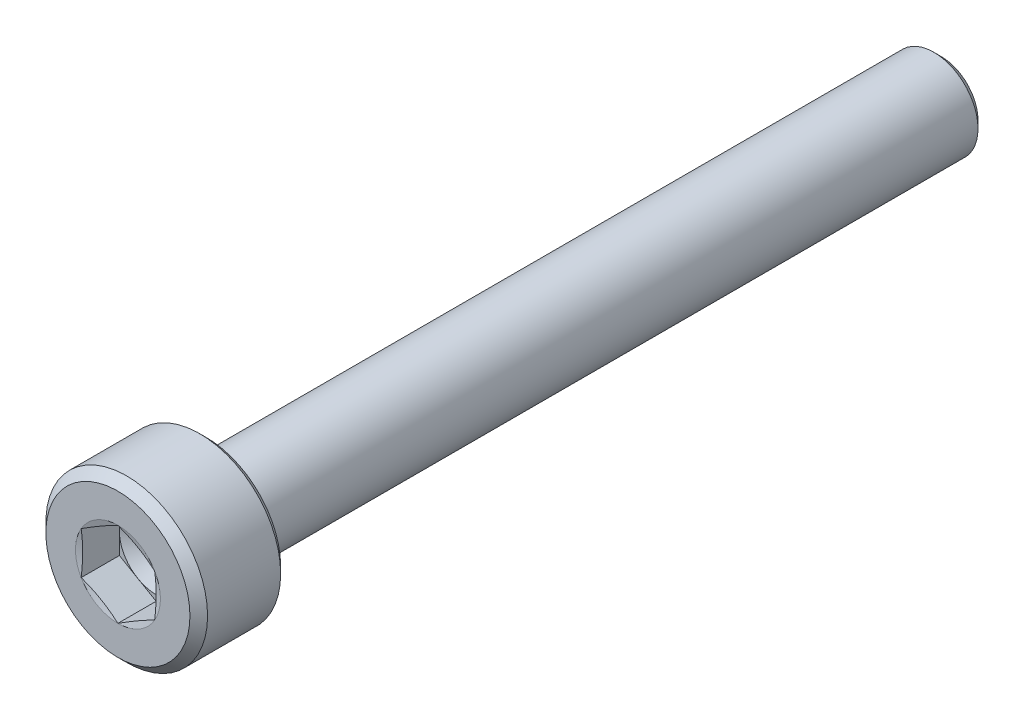
ISO-10303-21;
HEADER;
FILE_DESCRIPTION(('STEP AP214'),'2;1');
FILE_NAME('part.step','',(''),(''),'','','');
FILE_SCHEMA(('AUTOMOTIVE_DESIGN { 1 0 10303 214 1 1 1 1 }'));
ENDSEC;
DATA;
#1=APPLICATION_CONTEXT('core data for automotive mechanical design processes');
#2=APPLICATION_PROTOCOL_DEFINITION('international standard','automotive_design',2000,#1);
#3=PRODUCT_CONTEXT('',#1,'mechanical');
#4=PRODUCT('Part','Part','',(#3));
#5=PRODUCT_RELATED_PRODUCT_CATEGORY('part','',(#4));
#6=PRODUCT_DEFINITION_FORMATION('','',#4);
#7=PRODUCT_DEFINITION_CONTEXT('part definition',#1,'design');
#8=PRODUCT_DEFINITION('design','',#6,#7);
#9=PRODUCT_DEFINITION_SHAPE('','',#8);
#10=(LENGTH_UNIT() NAMED_UNIT(*) SI_UNIT(.MILLI.,.METRE.));
#11=(NAMED_UNIT(*) PLANE_ANGLE_UNIT() SI_UNIT($,.RADIAN.));
#12=(NAMED_UNIT(*) SI_UNIT($,.STERADIAN.) SOLID_ANGLE_UNIT());
#13=UNCERTAINTY_MEASURE_WITH_UNIT(LENGTH_MEASURE(1.E-05),#10,'distance_accuracy_value','');
#14=(GEOMETRIC_REPRESENTATION_CONTEXT(3) GLOBAL_UNCERTAINTY_ASSIGNED_CONTEXT((#13)) GLOBAL_UNIT_ASSIGNED_CONTEXT((#10,
#11,#12)) REPRESENTATION_CONTEXT('',''));
#15=CARTESIAN_POINT('',(0.,0.,0.));
#16=DIRECTION('',(0.,0.,1.));
#17=DIRECTION('',(1.,0.,0.));
#18=AXIS2_PLACEMENT_3D('',#15,#16,#17);
#19=CARTESIAN_POINT('',(0.,0.,0.));
#20=DIRECTION('',(0.,0.,-1.));
#21=DIRECTION('',(-1.,0.,0.));
#22=AXIS2_PLACEMENT_3D('',#19,#20,#21);
#23=PLANE('',#22);
#24=CARTESIAN_POINT('',(0.,0.,0.));
#25=DIRECTION('',(0.,0.,1.));
#26=DIRECTION('',(1.,0.,0.));
#27=AXIS2_PLACEMENT_3D('',#24,#25,#26);
#28=CIRCLE('',#27,2.44999999999999);
#29=CARTESIAN_POINT('',(2.44999999999999,0.,0.));
#30=VERTEX_POINT('',#29);
#31=EDGE_CURVE('E229',#30,#30,#28,.T.);
#32=ORIENTED_EDGE('',*,*,#31,.T.);
#33=EDGE_LOOP('',(#32));
#34=FACE_BOUND('',#33,.T.);
#35=CARTESIAN_POINT('',(0.,0.,0.));
#36=DIRECTION('',(0.,0.,1.));
#37=DIRECTION('',(1.,0.,0.));
#38=AXIS2_PLACEMENT_3D('',#35,#36,#37);
#39=CIRCLE('',#38,1.44337567297407);
#40=CARTESIAN_POINT('',(-1.25,-0.721687836487033,0.));
#41=VERTEX_POINT('',#40);
#42=CARTESIAN_POINT('',(0.,-1.44337567297407,0.));
#43=VERTEX_POINT('',#42);
#44=EDGE_CURVE('E155',#41,#43,#39,.T.);
#45=ORIENTED_EDGE('',*,*,#44,.F.);
#46=CARTESIAN_POINT('',(-1.25,0.721687836487033,0.));
#47=VERTEX_POINT('',#46);
#48=EDGE_CURVE('E154',#47,#41,#39,.T.);
#49=ORIENTED_EDGE('',*,*,#48,.F.);
#50=CARTESIAN_POINT('',(0.,1.44337567297407,0.));
#51=VERTEX_POINT('',#50);
#52=EDGE_CURVE('E121',#51,#47,#39,.T.);
#53=ORIENTED_EDGE('',*,*,#52,.F.);
#54=CARTESIAN_POINT('',(1.25,0.721687836487034,0.));
#55=VERTEX_POINT('',#54);
#56=EDGE_CURVE('E115',#55,#51,#39,.T.);
#57=ORIENTED_EDGE('',*,*,#56,.F.);
#58=CARTESIAN_POINT('',(1.25,-0.721687836487031,0.));
#59=VERTEX_POINT('',#58);
#60=EDGE_CURVE('E123',#59,#55,#39,.T.);
#61=ORIENTED_EDGE('',*,*,#60,.F.);
#62=EDGE_CURVE('E313',#43,#59,#39,.T.);
#63=ORIENTED_EDGE('',*,*,#62,.F.);
#64=EDGE_LOOP('',(#45,#49,#53,#57,#61,#63));
#65=FACE_BOUND('',#64,.T.);
#66=ADVANCED_FACE('F38',(#34,#65),#23,.F.);
#67=CARTESIAN_POINT('',(0.,0.,-0.3));
#68=DIRECTION('',(0.,0.,-1.));
#69=DIRECTION('',(-1.,0.,0.));
#70=AXIS2_PLACEMENT_3D('',#67,#68,#69);
#71=CONICAL_SURFACE('',#70,2.75,0.78539816339746);
#72=ORIENTED_EDGE('',*,*,#31,.F.);
#73=EDGE_LOOP('',(#72));
#74=FACE_BOUND('',#73,.T.);
#75=CARTESIAN_POINT('',(0.,0.,-0.3));
#76=DIRECTION('',(0.,0.,1.));
#77=DIRECTION('',(1.,0.,0.));
#78=AXIS2_PLACEMENT_3D('',#75,#76,#77);
#79=CIRCLE('',#78,2.75);
#80=CARTESIAN_POINT('',(2.75,0.,-0.3));
#81=VERTEX_POINT('',#80);
#82=EDGE_CURVE('E231',#81,#81,#79,.T.);
#83=ORIENTED_EDGE('',*,*,#82,.T.);
#84=EDGE_LOOP('',(#83));
#85=FACE_BOUND('',#84,.T.);
#86=ADVANCED_FACE('F220',(#74,#85),#71,.T.);
#87=CARTESIAN_POINT('',(0.,0.,0.));
#88=DIRECTION('',(0.,0.,1.));
#89=DIRECTION('',(1.,0.,0.));
#90=AXIS2_PLACEMENT_3D('',#87,#88,#89);
#91=CYLINDRICAL_SURFACE('',#90,2.75);
#92=ORIENTED_EDGE('',*,*,#82,.F.);
#93=EDGE_LOOP('',(#92));
#94=FACE_BOUND('',#93,.T.);
#95=CARTESIAN_POINT('',(0.,0.,-2.785));
#96=DIRECTION('',(0.,0.,1.));
#97=DIRECTION('',(1.,0.,0.));
#98=AXIS2_PLACEMENT_3D('',#95,#96,#97);
#99=CIRCLE('',#98,2.75);
#100=CARTESIAN_POINT('',(2.75,0.,-2.785));
#101=VERTEX_POINT('',#100);
#102=EDGE_CURVE('E234',#101,#101,#99,.T.);
#103=ORIENTED_EDGE('',*,*,#102,.T.);
#104=EDGE_LOOP('',(#103));
#105=FACE_BOUND('',#104,.T.);
#106=ADVANCED_FACE('F225',(#94,#105),#91,.T.);
#107=CARTESIAN_POINT('',(0.,0.,-3.));
#108=DIRECTION('',(0.,0.,1.));
#109=DIRECTION('',(1.,0.,0.));
#110=AXIS2_PLACEMENT_3D('',#107,#108,#109);
#111=CONICAL_SURFACE('',#110,2.535,0.785398163397449);
#112=ORIENTED_EDGE('',*,*,#102,.F.);
#113=EDGE_LOOP('',(#112));
#114=FACE_BOUND('',#113,.T.);
#115=CARTESIAN_POINT('',(0.,0.,-3.));
#116=DIRECTION('',(0.,0.,1.));
#117=DIRECTION('',(1.,0.,0.));
#118=AXIS2_PLACEMENT_3D('',#115,#116,#117);
#119=CIRCLE('',#118,2.535);
#120=CARTESIAN_POINT('',(2.535,0.,-3.));
#121=VERTEX_POINT('',#120);
#122=EDGE_CURVE('E239',#121,#121,#119,.T.);
#123=ORIENTED_EDGE('',*,*,#122,.T.);
#124=EDGE_LOOP('',(#123));
#125=FACE_BOUND('',#124,.T.);
#126=ADVANCED_FACE('F429',(#114,#125),#111,.T.);
#127=CARTESIAN_POINT('',(0.,2.535,-3.));
#128=DIRECTION('',(0.,0.,1.));
#129=DIRECTION('',(1.,0.,0.));
#130=AXIS2_PLACEMENT_3D('',#127,#128,#129);
#131=PLANE('',#130);
#132=ORIENTED_EDGE('',*,*,#122,.F.);
#133=EDGE_LOOP('',(#132));
#134=FACE_BOUND('',#133,.T.);
#135=CARTESIAN_POINT('',(0.,0.,-3.));
#136=DIRECTION('',(0.,0.,1.));
#137=DIRECTION('',(1.,0.,0.));
#138=AXIS2_PLACEMENT_3D('',#135,#136,#137);
#139=CIRCLE('',#138,1.8);
#140=CARTESIAN_POINT('',(1.8,0.,-3.));
#141=VERTEX_POINT('',#140);
#142=EDGE_CURVE('E242',#141,#141,#139,.T.);
#143=ORIENTED_EDGE('',*,*,#142,.T.);
#144=EDGE_LOOP('',(#143));
#145=FACE_BOUND('',#144,.T.);
#146=ADVANCED_FACE('F421',(#134,#145),#131,.F.);
#147=CARTESIAN_POINT('',(0.,0.,-3.1));
#148=DIRECTION('',(0.,0.,1.));
#149=DIRECTION('',(1.,0.,0.));
#150=AXIS2_PLACEMENT_3D('',#147,#148,#149);
#151=TOROIDAL_SURFACE('',#150,1.8,0.1);
#152=ORIENTED_EDGE('',*,*,#142,.F.);
#153=EDGE_LOOP('',(#152));
#154=FACE_BOUND('',#153,.T.);
#155=CARTESIAN_POINT('',(0.,0.,-3.05615763679786));
#156=DIRECTION('',(0.,0.,1.));
#157=DIRECTION('',(1.,0.,0.));
#158=AXIS2_PLACEMENT_3D('',#155,#156,#157);
#159=CIRCLE('',#158,1.71012315543561);
#160=CARTESIAN_POINT('',(1.71012315543561,0.,-3.05615763679786));
#161=VERTEX_POINT('',#160);
#162=EDGE_CURVE('E245',#161,#161,#159,.T.);
#163=ORIENTED_EDGE('',*,*,#162,.T.);
#164=EDGE_LOOP('',(#163));
#165=FACE_BOUND('',#164,.T.);
#166=ADVANCED_FACE('F413',(#154,#165),#151,.F.);
#167=CARTESIAN_POINT('',(0.,0.,-3.46615763679786));
#168=DIRECTION('',(0.,0.,1.));
#169=DIRECTION('',(1.,0.,0.));
#170=AXIS2_PLACEMENT_3D('',#167,#168,#169);
#171=CONICAL_SURFACE('',#170,1.51012315543561,0.453844001521511);
#172=ORIENTED_EDGE('',*,*,#162,.F.);
#173=EDGE_LOOP('',(#172));
#174=FACE_BOUND('',#173,.T.);
#175=CARTESIAN_POINT('',(0.,0.,-3.46615763679786));
#176=DIRECTION('',(0.,0.,1.));
#177=DIRECTION('',(1.,0.,0.));
#178=AXIS2_PLACEMENT_3D('',#175,#176,#177);
#179=CIRCLE('',#178,1.51012315543561);
#180=CARTESIAN_POINT('',(1.51012315543561,0.,-3.46615763679786));
#181=VERTEX_POINT('',#180);
#182=EDGE_CURVE('E248',#181,#181,#179,.T.);
#183=ORIENTED_EDGE('',*,*,#182,.T.);
#184=EDGE_LOOP('',(#183));
#185=FACE_BOUND('',#184,.T.);
#186=ADVANCED_FACE('F405',(#174,#185),#171,.T.);
#187=CARTESIAN_POINT('',(0.,0.,-3.51));
#188=DIRECTION('',(0.,0.,1.));
#189=DIRECTION('',(1.,0.,0.));
#190=AXIS2_PLACEMENT_3D('',#187,#188,#189);
#191=TOROIDAL_SURFACE('',#190,1.6,0.1);
#192=ORIENTED_EDGE('',*,*,#182,.F.);
#193=EDGE_LOOP('',(#192));
#194=FACE_BOUND('',#193,.T.);
#195=CARTESIAN_POINT('',(0.,0.,-3.51));
#196=DIRECTION('',(0.,0.,1.));
#197=DIRECTION('',(1.,0.,0.));
#198=AXIS2_PLACEMENT_3D('',#195,#196,#197);
#199=CIRCLE('',#198,1.5);
#200=CARTESIAN_POINT('',(1.5,0.,-3.51));
#201=VERTEX_POINT('',#200);
#202=EDGE_CURVE('E251',#201,#201,#199,.T.);
#203=ORIENTED_EDGE('',*,*,#202,.T.);
#204=EDGE_LOOP('',(#203));
#205=FACE_BOUND('',#204,.T.);
#206=ADVANCED_FACE('F397',(#194,#205),#191,.F.);
#207=CARTESIAN_POINT('',(0.,0.,0.));
#208=DIRECTION('',(0.,0.,1.));
#209=DIRECTION('',(1.,0.,0.));
#210=AXIS2_PLACEMENT_3D('',#207,#208,#209);
#211=CYLINDRICAL_SURFACE('',#210,1.5);
#212=ORIENTED_EDGE('',*,*,#202,.F.);
#213=EDGE_LOOP('',(#212));
#214=FACE_BOUND('',#213,.T.);
#215=CARTESIAN_POINT('',(0.,0.,-27.75));
#216=DIRECTION('',(0.,0.,1.));
#217=DIRECTION('',(1.,0.,0.));
#218=AXIS2_PLACEMENT_3D('',#215,#216,#217);
#219=CIRCLE('',#218,1.5);
#220=CARTESIAN_POINT('',(1.5,0.,-27.75));
#221=VERTEX_POINT('',#220);
#222=EDGE_CURVE('E254',#221,#221,#219,.T.);
#223=ORIENTED_EDGE('',*,*,#222,.T.);
#224=EDGE_LOOP('',(#223));
#225=FACE_BOUND('',#224,.T.);
#226=ADVANCED_FACE('F388',(#214,#225),#211,.T.);
#227=CARTESIAN_POINT('',(0.,0.,-28.));
#228=DIRECTION('',(0.,0.,1.));
#229=DIRECTION('',(1.,0.,0.));
#230=AXIS2_PLACEMENT_3D('',#227,#228,#229);
#231=CONICAL_SURFACE('',#230,1.25,0.785398163397441);
#232=ORIENTED_EDGE('',*,*,#222,.F.);
#233=EDGE_LOOP('',(#232));
#234=FACE_BOUND('',#233,.T.);
#235=CARTESIAN_POINT('',(0.,0.,-28.));
#236=DIRECTION('',(0.,0.,1.));
#237=DIRECTION('',(1.,0.,0.));
#238=AXIS2_PLACEMENT_3D('',#235,#236,#237);
#239=CIRCLE('',#238,1.25);
#240=CARTESIAN_POINT('',(1.25,0.,-28.));
#241=VERTEX_POINT('',#240);
#242=EDGE_CURVE('E257',#241,#241,#239,.T.);
#243=ORIENTED_EDGE('',*,*,#242,.T.);
#244=EDGE_LOOP('',(#243));
#245=FACE_BOUND('',#244,.T.);
#246=ADVANCED_FACE('F380',(#234,#245),#231,.T.);
#247=CARTESIAN_POINT('',(0.,1.25,-28.));
#248=DIRECTION('',(0.,0.,1.));
#249=DIRECTION('',(1.,0.,0.));
#250=AXIS2_PLACEMENT_3D('',#247,#248,#249);
#251=PLANE('',#250);
#252=ORIENTED_EDGE('',*,*,#242,.F.);
#253=EDGE_LOOP('',(#252));
#254=FACE_BOUND('',#253,.T.);
#255=ADVANCED_FACE('F374',(#254),#251,.F.);
#256=CARTESIAN_POINT('',(0.,0.,-0.0518148554092243));
#257=DIRECTION('',(0.,0.,1.));
#258=DIRECTION('',(1.,0.,0.));
#259=AXIS2_PLACEMENT_3D('',#256,#257,#258);
#260=CONICAL_SURFACE('',#259,1.25,1.30899693899575);
#261=ORIENTED_EDGE('',*,*,#52,.T.);
#262=CARTESIAN_POINT('',(-1.2502,0.721572366433195,3.09438201916871E-05));
#263=CARTESIAN_POINT('',(-1.19827409383526,0.751551802335321,-0.00800698378926622));
#264=CARTESIAN_POINT('',(-1.14625401362102,0.781585609650283,-0.0153042105125454));
#265=CARTESIAN_POINT('',(-1.04203006351459,0.841759335300235,-0.0281248924452036));
#266=CARTESIAN_POINT('',(-0.989826127596593,0.871899291755248,-0.0336476265269101));
#267=CARTESIAN_POINT('',(-0.88555111655682,0.932102497448812,-0.0425967858491088));
#268=CARTESIAN_POINT('',(-0.833480747184869,0.962165339222511,-0.0460338877791617));
#269=CARTESIAN_POINT('',(-0.729273575326724,1.0223293779463,-0.0506427032068));
#270=CARTESIAN_POINT('',(-0.677136787663362,1.05243056633842,-0.0518148554092241));
#271=CARTESIAN_POINT('',(-0.572863212336638,1.11263294312267,-0.0518148554092241));
#272=CARTESIAN_POINT('',(-0.520726424673275,1.1427341315148,-0.0506427032068001));
#273=CARTESIAN_POINT('',(-0.416519252815131,1.20289817023859,-0.0460338877791617));
#274=CARTESIAN_POINT('',(-0.36444888344318,1.23296101201229,-0.0425967858491088));
#275=CARTESIAN_POINT('',(-0.260173872403407,1.29316421770585,-0.03364762652691));
#276=CARTESIAN_POINT('',(-0.207969936485411,1.32330417416086,-0.0281248924452036));
#277=CARTESIAN_POINT('',(-0.103745986378985,1.38347789981082,-0.0153042105125453));
#278=CARTESIAN_POINT('',(-0.0517259061647358,1.41351170712578,-0.00800698378926612));
#279=CARTESIAN_POINT('',(0.00020000000000038,1.4434911430279,3.09438201918299E-05));
#280=B_SPLINE_CURVE_WITH_KNOTS('',3,(#262,#263,#264,#265,#266,#267,#268,#269,#270,#271,#272,
#273,#274,#275,#276,#277,#278,#279),.UNSPECIFIED.,.F.,.F.,(4,2,2,2,2,2,2,2,4),(0.,
0.18149525192516,0.363064167833313,0.543695584294992,0.724292010212745,0.9048884361305,
1.08551985259218,1.26708876850033,1.44858402042549),.UNSPECIFIED.);
#281=EDGE_CURVE('E11',#47,#51,#280,.T.);
#282=ORIENTED_EDGE('',*,*,#281,.T.);
#283=EDGE_LOOP('',(#261,#282));
#284=FACE_BOUND('',#283,.T.);
#285=ADVANCED_FACE('F127',(#284),#260,.F.);
#286=CARTESIAN_POINT('',(-1.25,-1.90803764372689,0.224449375411132));
#287=CARTESIAN_POINT('',(-1.25,-1.8513410457493,0.21174373926854));
#288=CARTESIAN_POINT('',(-1.25,-1.79460907964503,0.199195804458375));
#289=CARTESIAN_POINT('',(-1.25,-1.68105673477474,0.174495010900465));
#290=CARTESIAN_POINT('',(-1.25,-1.62423635229394,0.162342169249333));
#291=CARTESIAN_POINT('',(-1.25,-1.4535135757121,0.126574423752231));
#292=CARTESIAN_POINT('',(-1.25,-1.33945900339908,0.103675151182616));
#293=CARTESIAN_POINT('',(-1.25,-1.11170727260793,0.0609587630346281));
#294=CARTESIAN_POINT('',(-1.25,-0.998014548362105,0.0411184667683871));
#295=CARTESIAN_POINT('',(-1.25,-0.769948454688276,0.00583266905587686));
#296=CARTESIAN_POINT('',(-1.25,-0.655575207287998,-0.00961359741797872));
#297=CARTESIAN_POINT('',(-1.25,-0.424787181644499,-0.0341426384914952));
#298=CARTESIAN_POINT('',(-1.25,-0.308363938645654,-0.0431515305449703));
#299=CARTESIAN_POINT('',(-1.25,-0.133499226938177,-0.0502674214127566));
#300=CARTESIAN_POINT('',(-1.25,-0.0751823293286765,-0.0515734559811251));
#301=CARTESIAN_POINT('',(-1.25,0.0414593912908041,-0.0519953132862497));
#302=CARTESIAN_POINT('',(-1.25,0.0997842142946219,-0.0511111377164467));
#303=CARTESIAN_POINT('',(-1.25,0.275064939261687,-0.0452058780708578));
#304=CARTESIAN_POINT('',(-1.25,0.391917619612776,-0.0369155048717787));
#305=CARTESIAN_POINT('',(-1.25,0.624955711707257,-0.013420604100275));
#306=CARTESIAN_POINT('',(-1.25,0.741140574853819,0.00178895996036897));
#307=CARTESIAN_POINT('',(-1.25,0.965009686747211,0.0357098573203466));
#308=CARTESIAN_POINT('',(-1.25,1.07274149713457,0.0541179629895213));
#309=CARTESIAN_POINT('',(-1.25,1.28770836040789,0.0936619087242774));
#310=CARTESIAN_POINT('',(-1.25,1.39494334881407,0.114798093117207));
#311=CARTESIAN_POINT('',(-1.25,1.60905523406172,0.158897571848756));
#312=CARTESIAN_POINT('',(-1.25,1.71593205434096,0.181861233731142));
#313=CARTESIAN_POINT('',(-1.25,1.92941059122614,0.229035853527515));
#314=CARTESIAN_POINT('',(-1.25,2.0360123020935,0.253246837242345));
#315=CARTESIAN_POINT('',(-1.25,2.24796149236902,0.302300913060499));
#316=CARTESIAN_POINT('',(-1.25,2.35331096915779,0.32713541151495));
#317=CARTESIAN_POINT('',(-1.25,2.56386296226419,0.377426560036597));
#318=CARTESIAN_POINT('',(-1.25,2.66906547587909,0.402883221390532));
#319=CARTESIAN_POINT('',(-1.25,2.87922866754162,0.454224569867166));
#320=CARTESIAN_POINT('',(-1.25,2.98418948388924,0.4801086920956));
#321=CARTESIAN_POINT('',(-1.25,3.19401964928918,0.53223064686748));
#322=CARTESIAN_POINT('',(-1.25,3.29888900123911,0.558468467737611));
#323=CARTESIAN_POINT('',(-1.25,3.40372646605654,0.5848316076134));
#324=B_SPLINE_CURVE_WITH_KNOTS('',3,(#286,#287,#288,#289,#290,#291,#292,#293,#294,#295,#296,
#297,#298,#299,#300,#301,#302,#303,#304,#305,#306,#307,#308,#309,#310,#311,#312,#313,#314,#315,
#316,#317,#318,#319,#320,#321,#322,#323),.UNSPECIFIED.,.F.,.F.,(4,2,2,2,2,2,2,2,2,2,2,2,2,2,2,2,
2,2,4),(0.,0.17430798332962,0.348623499364559,0.697591208701206,1.04376859165833,
1.38988566606611,1.73991400543005,1.91487041156219,2.08982668242046,2.44096537417444,
2.79236007022679,3.12019018011378,3.44806170796195,3.77599934506425,4.10394376827983,
4.4286525086615,4.75336714400545,5.07768244044904,5.40198705941089),.UNSPECIFIED.);
#325=EDGE_CURVE('E120',#41,#47,#324,.T.);
#326=ORIENTED_EDGE('',*,*,#325,.T.);
#327=ORIENTED_EDGE('',*,*,#48,.T.);
#328=EDGE_LOOP('',(#326,#327));
#329=FACE_BOUND('',#328,.T.);
#330=ADVANCED_FACE('F361',(#329),#260,.F.);
#331=CARTESIAN_POINT('',(0.000199999999999765,-1.4434911430279,3.09438201913897E-05));
#332=CARTESIAN_POINT('',(-0.0517259061647364,-1.41351170712578,-0.0080069837892665));
#333=CARTESIAN_POINT('',(-0.103745986378985,-1.38347789981081,-0.0153042105125457));
#334=CARTESIAN_POINT('',(-0.207969936485412,-1.32330417416086,-0.028124892445204));
#335=CARTESIAN_POINT('',(-0.260173872403408,-1.29316421770585,-0.0336476265269104));
#336=CARTESIAN_POINT('',(-0.36444888344318,-1.23296101201229,-0.0425967858491091));
#337=CARTESIAN_POINT('',(-0.416519252815131,-1.20289817023859,-0.046033887779162));
#338=CARTESIAN_POINT('',(-0.520726424673276,-1.1427341315148,-0.0506427032068003));
#339=CARTESIAN_POINT('',(-0.572863212336638,-1.11263294312267,-0.0518148554092244));
#340=CARTESIAN_POINT('',(-0.677136787663362,-1.05243056633842,-0.0518148554092244));
#341=CARTESIAN_POINT('',(-0.729273575326725,-1.0223293779463,-0.0506427032068003));
#342=CARTESIAN_POINT('',(-0.833480747184869,-0.962165339222509,-0.046033887779162));
#343=CARTESIAN_POINT('',(-0.88555111655682,-0.93210249744881,-0.0425967858491091));
#344=CARTESIAN_POINT('',(-0.989826127596593,-0.871899291755246,-0.0336476265269103));
#345=CARTESIAN_POINT('',(-1.04203006351459,-0.841759335300233,-0.0281248924452038));
#346=CARTESIAN_POINT('',(-1.14625401362102,-0.781585609650282,-0.0153042105125455));
#347=CARTESIAN_POINT('',(-1.19827409383526,-0.75155180233532,-0.00800698378926632));
#348=CARTESIAN_POINT('',(-1.2502,-0.721572366433194,3.09438201915463E-05));
#349=B_SPLINE_CURVE_WITH_KNOTS('',3,(#331,#332,#333,#334,#335,#336,#337,#338,#339,#340,#341,
#342,#343,#344,#345,#346,#347,#348),.UNSPECIFIED.,.F.,.F.,(4,2,2,2,2,2,2,2,4),(0.,
0.18149525192516,0.363064167833313,0.543695584294991,0.724292010212745,0.904888436130499,
1.08551985259218,1.26708876850033,1.44858402042549),.UNSPECIFIED.);
#350=EDGE_CURVE('E163',#43,#41,#349,.T.);
#351=ORIENTED_EDGE('',*,*,#350,.T.);
#352=ORIENTED_EDGE('',*,*,#44,.T.);
#353=EDGE_LOOP('',(#351,#352));
#354=FACE_BOUND('',#353,.T.);
#355=ADVANCED_FACE('F355',(#354),#260,.F.);
#356=CARTESIAN_POINT('',(1.2502,-0.721572366433195,3.09438201914613E-05));
#357=CARTESIAN_POINT('',(1.19827409383526,-0.75155180233532,-0.00800698378926647));
#358=CARTESIAN_POINT('',(1.14625401362101,-0.781585609650283,-0.0153042105125457));
#359=CARTESIAN_POINT('',(1.04203006351459,-0.841759335300234,-0.0281248924452039));
#360=CARTESIAN_POINT('',(0.989826127596592,-0.871899291755247,-0.0336476265269103));
#361=CARTESIAN_POINT('',(0.88555111655682,-0.932102497448811,-0.042596785849109));
#362=CARTESIAN_POINT('',(0.833480747184869,-0.96216533922251,-0.046033887779162));
#363=CARTESIAN_POINT('',(0.729273575326724,-1.0223293779463,-0.0506427032068003));
#364=CARTESIAN_POINT('',(0.677136787663362,-1.05243056633842,-0.0518148554092244));
#365=CARTESIAN_POINT('',(0.572863212336637,-1.11263294312267,-0.0518148554092244));
#366=CARTESIAN_POINT('',(0.520726424673275,-1.1427341315148,-0.0506427032068003));
#367=CARTESIAN_POINT('',(0.416519252815131,-1.20289817023859,-0.046033887779162));
#368=CARTESIAN_POINT('',(0.36444888344318,-1.23296101201229,-0.042596785849109));
#369=CARTESIAN_POINT('',(0.260173872403407,-1.29316421770585,-0.0336476265269103));
#370=CARTESIAN_POINT('',(0.207969936485411,-1.32330417416086,-0.028124892445204));
#371=CARTESIAN_POINT('',(0.103745986378985,-1.38347789981081,-0.0153042105125458));
#372=CARTESIAN_POINT('',(0.0517259061647362,-1.41351170712578,-0.00800698378926656));
#373=CARTESIAN_POINT('',(-0.000200000000000036,-1.4434911430279,3.09438201914066E-05));
#374=B_SPLINE_CURVE_WITH_KNOTS('',3,(#356,#357,#358,#359,#360,#361,#362,#363,#364,#365,#366,
#367,#368,#369,#370,#371,#372,#373),.UNSPECIFIED.,.F.,.F.,(4,2,2,2,2,2,2,2,4),(0.,
0.18149525192516,0.363064167833312,0.543695584294991,0.724292010212745,0.904888436130499,
1.08551985259218,1.26708876850033,1.44858402042549),.UNSPECIFIED.);
#375=EDGE_CURVE('E183',#59,#43,#374,.T.);
#376=ORIENTED_EDGE('',*,*,#375,.T.);
#377=ORIENTED_EDGE('',*,*,#62,.T.);
#378=EDGE_LOOP('',(#376,#377));
#379=FACE_BOUND('',#378,.T.);
#380=ADVANCED_FACE('F349',(#379),#260,.F.);
#381=CARTESIAN_POINT('',(1.25,-1.90803764372689,0.224449375411132));
#382=CARTESIAN_POINT('',(1.25,-1.8513410457493,0.21174373926854));
#383=CARTESIAN_POINT('',(1.25,-1.79460907964503,0.199195804458375));
#384=CARTESIAN_POINT('',(1.25,-1.68105673477474,0.174495010900465));
#385=CARTESIAN_POINT('',(1.25,-1.62423635229394,0.162342169249333));
#386=CARTESIAN_POINT('',(1.25,-1.4535135757121,0.126574423752231));
#387=CARTESIAN_POINT('',(1.25,-1.33945900339908,0.103675151182616));
#388=CARTESIAN_POINT('',(1.25,-1.11170727260793,0.0609587630346278));
#389=CARTESIAN_POINT('',(1.25,-0.998014548362105,0.0411184667683869));
#390=CARTESIAN_POINT('',(1.25,-0.769948454688276,0.00583266905587672));
#391=CARTESIAN_POINT('',(1.25,-0.655575207287999,-0.00961359741797884));
#392=CARTESIAN_POINT('',(1.25,-0.4247871816445,-0.0341426384914953));
#393=CARTESIAN_POINT('',(1.25,-0.308363938645655,-0.0431515305449704));
#394=CARTESIAN_POINT('',(1.25,-0.133499226938178,-0.0502674214127568));
#395=CARTESIAN_POINT('',(1.25,-0.0751823293286781,-0.0515734559811252));
#396=CARTESIAN_POINT('',(1.25,0.0414593912908024,-0.0519953132862499));
#397=CARTESIAN_POINT('',(1.25,0.0997842142946203,-0.0511111377164469));
#398=CARTESIAN_POINT('',(1.25,0.275064939261685,-0.045205878070858));
#399=CARTESIAN_POINT('',(1.25,0.391917619612775,-0.036915504871779));
#400=CARTESIAN_POINT('',(1.25,0.624955711707256,-0.0134206041002753));
#401=CARTESIAN_POINT('',(1.25,0.741140574853817,0.00178895996036867));
#402=CARTESIAN_POINT('',(1.25,0.96500968674721,0.0357098573203462));
#403=CARTESIAN_POINT('',(1.25,1.07274149713457,0.054117962989521));
#404=CARTESIAN_POINT('',(1.25,1.28770836040789,0.093661908724277));
#405=CARTESIAN_POINT('',(1.25,1.39494334881407,0.114798093117207));
#406=CARTESIAN_POINT('',(1.25,1.60905523406172,0.158897571848756));
#407=CARTESIAN_POINT('',(1.25,1.71593205434096,0.181861233731142));
#408=CARTESIAN_POINT('',(1.25,1.92941059122614,0.229035853527516));
#409=CARTESIAN_POINT('',(1.25,2.0360123020935,0.253246837242345));
#410=CARTESIAN_POINT('',(1.25,2.24796149236902,0.302300913060499));
#411=CARTESIAN_POINT('',(1.25,2.35331096915779,0.32713541151495));
#412=CARTESIAN_POINT('',(1.25,2.56386296226419,0.377426560036597));
#413=CARTESIAN_POINT('',(1.25,2.66906547587909,0.402883221390532));
#414=CARTESIAN_POINT('',(1.25,2.87922866754162,0.454224569867166));
#415=CARTESIAN_POINT('',(1.25,2.98418948388924,0.4801086920956));
#416=CARTESIAN_POINT('',(1.25,3.19401964928918,0.53223064686748));
#417=CARTESIAN_POINT('',(1.25,3.29888900123911,0.558468467737611));
#418=CARTESIAN_POINT('',(1.25,3.40372646605654,0.5848316076134));
#419=B_SPLINE_CURVE_WITH_KNOTS('',3,(#381,#382,#383,#384,#385,#386,#387,#388,#389,#390,#391,
#392,#393,#394,#395,#396,#397,#398,#399,#400,#401,#402,#403,#404,#405,#406,#407,#408,#409,#410,
#411,#412,#413,#414,#415,#416,#417,#418),.UNSPECIFIED.,.F.,.F.,(4,2,2,2,2,2,2,2,2,2,2,2,2,2,2,2,
2,2,4),(0.,0.17430798332962,0.348623499364559,0.697591208701206,1.04376859165833,
1.38988566606611,1.73991400543005,1.91487041156219,2.08982668242046,2.44096537417444,
2.79236007022679,3.12019018011378,3.44806170796195,3.77599934506425,4.10394376827983,
4.4286525086615,4.75336714400545,5.07768244044904,5.40198705941089),.UNSPECIFIED.);
#420=EDGE_CURVE('E63',#55,#59,#419,.F.);
#421=ORIENTED_EDGE('',*,*,#420,.T.);
#422=ORIENTED_EDGE('',*,*,#60,.T.);
#423=EDGE_LOOP('',(#421,#422));
#424=FACE_BOUND('',#423,.T.);
#425=ADVANCED_FACE('F176',(#424),#260,.F.);
#426=CARTESIAN_POINT('',(-0.000199999999999885,1.4434911430279,3.09438201917452E-05));
#427=CARTESIAN_POINT('',(0.0517259061647365,1.41351170712578,-0.00800698378926616));
#428=CARTESIAN_POINT('',(0.103745986378985,1.38347789981081,-0.0153042105125454));
#429=CARTESIAN_POINT('',(0.207969936485411,1.32330417416086,-0.0281248924452036));
#430=CARTESIAN_POINT('',(0.260173872403408,1.29316421770585,-0.03364762652691));
#431=CARTESIAN_POINT('',(0.36444888344318,1.23296101201229,-0.0425967858491087));
#432=CARTESIAN_POINT('',(0.416519252815131,1.20289817023859,-0.0460338877791617));
#433=CARTESIAN_POINT('',(0.520726424673275,1.1427341315148,-0.0506427032068));
#434=CARTESIAN_POINT('',(0.572863212336638,1.11263294312267,-0.0518148554092241));
#435=CARTESIAN_POINT('',(0.677136787663362,1.05243056633842,-0.0518148554092242));
#436=CARTESIAN_POINT('',(0.729273575326724,1.0223293779463,-0.0506427032068001));
#437=CARTESIAN_POINT('',(0.833480747184869,0.962165339222511,-0.0460338877791617));
#438=CARTESIAN_POINT('',(0.88555111655682,0.932102497448812,-0.0425967858491088));
#439=CARTESIAN_POINT('',(0.989826127596592,0.871899291755248,-0.0336476265269101));
#440=CARTESIAN_POINT('',(1.04203006351459,0.841759335300235,-0.0281248924452037));
#441=CARTESIAN_POINT('',(1.14625401362101,0.781585609650283,-0.0153042105125454));
#442=CARTESIAN_POINT('',(1.19827409383526,0.751551802335321,-0.00800698378926624));
#443=CARTESIAN_POINT('',(1.2502,0.721572366433195,3.09438201916591E-05));
#444=B_SPLINE_CURVE_WITH_KNOTS('',3,(#426,#427,#428,#429,#430,#431,#432,#433,#434,#435,#436,
#437,#438,#439,#440,#441,#442,#443),.UNSPECIFIED.,.F.,.F.,(4,2,2,2,2,2,2,2,4),(0.,
0.18149525192516,0.363064167833313,0.543695584294991,0.724292010212745,0.904888436130499,
1.08551985259218,1.26708876850033,1.44858402042549),.UNSPECIFIED.);
#445=EDGE_CURVE('E57',#51,#55,#444,.T.);
#446=ORIENTED_EDGE('',*,*,#445,.T.);
#447=ORIENTED_EDGE('',*,*,#56,.T.);
#448=EDGE_LOOP('',(#446,#447));
#449=FACE_BOUND('',#448,.T.);
#450=ADVANCED_FACE('F116',(#449),#260,.F.);
#451=CARTESIAN_POINT('',(0.,0.,-2.02168783648703));
#452=DIRECTION('',(0.,0.,1.));
#453=DIRECTION('',(1.,0.,0.));
#454=AXIS2_PLACEMENT_3D('',#451,#452,#453);
#455=CONICAL_SURFACE('',#454,0.,1.0471975511966);
#456=CARTESIAN_POINT('',(0.,0.,-1.3));
#457=DIRECTION('',(0.,0.,1.));
#458=DIRECTION('',(1.,0.,0.));
#459=AXIS2_PLACEMENT_3D('',#456,#457,#458);
#460=CIRCLE('',#459,1.25);
#461=CARTESIAN_POINT('',(1.25,0.,-1.3));
#462=VERTEX_POINT('',#461);
#463=CARTESIAN_POINT('',(0.625,1.08253175473055,-1.3));
#464=VERTEX_POINT('',#463);
#465=EDGE_CURVE('E143',#462,#464,#460,.T.);
#466=ORIENTED_EDGE('',*,*,#465,.T.);
#467=CARTESIAN_POINT('',(-0.625,1.08253175473055,-1.3));
#468=VERTEX_POINT('',#467);
#469=EDGE_CURVE('E51',#464,#468,#460,.T.);
#470=ORIENTED_EDGE('',*,*,#469,.T.);
#471=CARTESIAN_POINT('',(-1.25,0.,-1.3));
#472=VERTEX_POINT('',#471);
#473=EDGE_CURVE('E294',#468,#472,#460,.T.);
#474=ORIENTED_EDGE('',*,*,#473,.T.);
#475=CARTESIAN_POINT('',(-0.625,-1.08253175473055,-1.3));
#476=VERTEX_POINT('',#475);
#477=EDGE_CURVE('E296',#472,#476,#460,.T.);
#478=ORIENTED_EDGE('',*,*,#477,.T.);
#479=CARTESIAN_POINT('',(0.624999999999999,-1.08253175473055,-1.3));
#480=VERTEX_POINT('',#479);
#481=EDGE_CURVE('E232',#476,#480,#460,.T.);
#482=ORIENTED_EDGE('',*,*,#481,.T.);
#483=EDGE_CURVE('E230',#480,#462,#460,.T.);
#484=ORIENTED_EDGE('',*,*,#483,.T.);
#485=EDGE_LOOP('',(#466,#470,#474,#478,#482,#484));
#486=FACE_BOUND('',#485,.T.);
#487=CARTESIAN_POINT('',(0.,0.,-2.02168783648703));
#488=VERTEX_POINT('',#487);
#489=VERTEX_LOOP('',#488);
#490=FACE_BOUND('',#489,.T.);
#491=ADVANCED_FACE('F175',(#486,#490),#455,.F.);
#492=CARTESIAN_POINT('',(0.,0.,-1.3));
#493=DIRECTION('',(0.,0.,1.));
#494=DIRECTION('',(1.,0.,0.));
#495=AXIS2_PLACEMENT_3D('',#492,#493,#494);
#496=PLANE('',#495);
#497=ORIENTED_EDGE('',*,*,#465,.F.);
#498=DIRECTION('',(0.,1.,0.));
#499=VECTOR('',#498,1.);
#500=CARTESIAN_POINT('',(1.25,-0.721687836487033,-1.3));
#501=LINE('',#500,#499);
#502=CARTESIAN_POINT('',(1.25,0.721687836487033,-1.3));
#503=VERTEX_POINT('',#502);
#504=EDGE_CURVE('E273',#462,#503,#501,.T.);
#505=ORIENTED_EDGE('',*,*,#504,.T.);
#506=DIRECTION('',(-0.866025403784439,0.5,0.));
#507=VECTOR('',#506,1.);
#508=CARTESIAN_POINT('',(1.25,0.721687836487033,-1.3));
#509=LINE('',#508,#507);
#510=EDGE_CURVE('E288',#503,#464,#509,.T.);
#511=ORIENTED_EDGE('',*,*,#510,.T.);
#512=EDGE_LOOP('',(#497,#505,#511));
#513=FACE_BOUND('',#512,.T.);
#514=ADVANCED_FACE('F318',(#513),#496,.T.);
#515=ORIENTED_EDGE('',*,*,#483,.F.);
#516=DIRECTION('',(0.866025403784439,0.5,0.));
#517=VECTOR('',#516,1.);
#518=CARTESIAN_POINT('',(0.,-1.44337567297406,-1.3));
#519=LINE('',#518,#517);
#520=CARTESIAN_POINT('',(1.25,-0.721687836487033,-1.3));
#521=VERTEX_POINT('',#520);
#522=EDGE_CURVE('E277',#480,#521,#519,.T.);
#523=ORIENTED_EDGE('',*,*,#522,.T.);
#524=EDGE_CURVE('E150',#521,#462,#501,.T.);
#525=ORIENTED_EDGE('',*,*,#524,.T.);
#526=EDGE_LOOP('',(#515,#523,#525));
#527=FACE_BOUND('',#526,.T.);
#528=ADVANCED_FACE('F206',(#527),#496,.T.);
#529=ORIENTED_EDGE('',*,*,#481,.F.);
#530=DIRECTION('',(0.866025403784439,-0.5,0.));
#531=VECTOR('',#530,1.);
#532=CARTESIAN_POINT('',(-1.25,-0.721687836487032,-1.3));
#533=LINE('',#532,#531);
#534=CARTESIAN_POINT('',(0.,-1.44337567297406,-1.3));
#535=VERTEX_POINT('',#534);
#536=EDGE_CURVE('E281',#476,#535,#533,.T.);
#537=ORIENTED_EDGE('',*,*,#536,.T.);
#538=EDGE_CURVE('E274',#535,#480,#519,.T.);
#539=ORIENTED_EDGE('',*,*,#538,.T.);
#540=EDGE_LOOP('',(#529,#537,#539));
#541=FACE_BOUND('',#540,.T.);
#542=ADVANCED_FACE('F309',(#541),#496,.T.);
#543=ORIENTED_EDGE('',*,*,#477,.F.);
#544=DIRECTION('',(0.,-1.,0.));
#545=VECTOR('',#544,1.);
#546=CARTESIAN_POINT('',(-1.25,0.721687836487033,-1.3));
#547=LINE('',#546,#545);
#548=CARTESIAN_POINT('',(-1.25,-0.721687836487032,-1.3));
#549=VERTEX_POINT('',#548);
#550=EDGE_CURVE('E285',#472,#549,#547,.T.);
#551=ORIENTED_EDGE('',*,*,#550,.T.);
#552=EDGE_CURVE('E278',#549,#476,#533,.T.);
#553=ORIENTED_EDGE('',*,*,#552,.T.);
#554=EDGE_LOOP('',(#543,#551,#553));
#555=FACE_BOUND('',#554,.T.);
#556=ADVANCED_FACE('F323',(#555),#496,.T.);
#557=ORIENTED_EDGE('',*,*,#469,.F.);
#558=CARTESIAN_POINT('',(0.,1.44337567297407,-1.3));
#559=VERTEX_POINT('',#558);
#560=EDGE_CURVE('E290',#464,#559,#509,.T.);
#561=ORIENTED_EDGE('',*,*,#560,.T.);
#562=DIRECTION('',(-0.866025403784439,-0.5,0.));
#563=VECTOR('',#562,1.);
#564=CARTESIAN_POINT('',(0.,1.44337567297407,-1.3));
#565=LINE('',#564,#563);
#566=EDGE_CURVE('E148',#559,#468,#565,.T.);
#567=ORIENTED_EDGE('',*,*,#566,.T.);
#568=EDGE_LOOP('',(#557,#561,#567));
#569=FACE_BOUND('',#568,.T.);
#570=ADVANCED_FACE('F320',(#569),#496,.T.);
#571=ORIENTED_EDGE('',*,*,#473,.F.);
#572=CARTESIAN_POINT('',(-1.25,0.721687836487033,-1.3));
#573=VERTEX_POINT('',#572);
#574=EDGE_CURVE('E287',#468,#573,#565,.T.);
#575=ORIENTED_EDGE('',*,*,#574,.T.);
#576=EDGE_CURVE('E282',#573,#472,#547,.T.);
#577=ORIENTED_EDGE('',*,*,#576,.T.);
#578=EDGE_LOOP('',(#571,#575,#577));
#579=FACE_BOUND('',#578,.T.);
#580=ADVANCED_FACE('F322',(#579),#496,.T.);
#581=CARTESIAN_POINT('',(0.,1.44337567297407,-1.3));
#582=DIRECTION('',(-0.5,0.866025403784439,0.));
#583=DIRECTION('',(-0.866025403784439,-0.5,0.));
#584=AXIS2_PLACEMENT_3D('',#581,#582,#583);
#585=PLANE('',#584);
#586=ORIENTED_EDGE('',*,*,#281,.F.);
#587=DIRECTION('',(0.,0.,1.));
#588=VECTOR('',#587,1.);
#589=CARTESIAN_POINT('',(-1.25,0.721687836487033,-1.3));
#590=LINE('',#589,#588);
#591=EDGE_CURVE('E149',#573,#47,#590,.T.);
#592=ORIENTED_EDGE('',*,*,#591,.F.);
#593=ORIENTED_EDGE('',*,*,#574,.F.);
#594=ORIENTED_EDGE('',*,*,#566,.F.);
#595=DIRECTION('',(0.,0.,1.));
#596=VECTOR('',#595,1.);
#597=CARTESIAN_POINT('',(0.,1.44337567297407,-1.3));
#598=LINE('',#597,#596);
#599=EDGE_CURVE('E138',#559,#51,#598,.T.);
#600=ORIENTED_EDGE('',*,*,#599,.T.);
#601=EDGE_LOOP('',(#586,#592,#593,#594,#600));
#602=FACE_BOUND('',#601,.T.);
#603=ADVANCED_FACE('F145',(#602),#585,.F.);
#604=CARTESIAN_POINT('',(-1.25,0.721687836487033,-1.3));
#605=DIRECTION('',(-1.,0.,0.));
#606=DIRECTION('',(0.,0.,1.));
#607=AXIS2_PLACEMENT_3D('',#604,#605,#606);
#608=PLANE('',#607);
#609=ORIENTED_EDGE('',*,*,#325,.F.);
#610=DIRECTION('',(0.,0.,1.));
#611=VECTOR('',#610,1.);
#612=CARTESIAN_POINT('',(-1.25,-0.721687836487032,-1.3));
#613=LINE('',#612,#611);
#614=EDGE_CURVE('E261',#549,#41,#613,.T.);
#615=ORIENTED_EDGE('',*,*,#614,.F.);
#616=ORIENTED_EDGE('',*,*,#550,.F.);
#617=ORIENTED_EDGE('',*,*,#576,.F.);
#618=ORIENTED_EDGE('',*,*,#591,.T.);
#619=EDGE_LOOP('',(#609,#615,#616,#617,#618));
#620=FACE_BOUND('',#619,.T.);
#621=ADVANCED_FACE('F170',(#620),#608,.F.);
#622=CARTESIAN_POINT('',(-1.25,-0.721687836487032,-1.3));
#623=DIRECTION('',(-0.5,-0.866025403784439,0.));
#624=DIRECTION('',(0.866025403784439,-0.5,0.));
#625=AXIS2_PLACEMENT_3D('',#622,#623,#624);
#626=PLANE('',#625);
#627=ORIENTED_EDGE('',*,*,#350,.F.);
#628=DIRECTION('',(0.,0.,1.));
#629=VECTOR('',#628,1.);
#630=CARTESIAN_POINT('',(0.,-1.44337567297406,-1.3));
#631=LINE('',#630,#629);
#632=EDGE_CURVE('E264',#535,#43,#631,.T.);
#633=ORIENTED_EDGE('',*,*,#632,.F.);
#634=ORIENTED_EDGE('',*,*,#536,.F.);
#635=ORIENTED_EDGE('',*,*,#552,.F.);
#636=ORIENTED_EDGE('',*,*,#614,.T.);
#637=EDGE_LOOP('',(#627,#633,#634,#635,#636));
#638=FACE_BOUND('',#637,.T.);
#639=ADVANCED_FACE('F209',(#638),#626,.F.);
#640=CARTESIAN_POINT('',(0.,-1.44337567297406,-1.3));
#641=DIRECTION('',(0.5,-0.866025403784439,0.));
#642=DIRECTION('',(0.866025403784439,0.5,0.));
#643=AXIS2_PLACEMENT_3D('',#640,#641,#642);
#644=PLANE('',#643);
#645=ORIENTED_EDGE('',*,*,#375,.F.);
#646=DIRECTION('',(0.,0.,1.));
#647=VECTOR('',#646,1.);
#648=CARTESIAN_POINT('',(1.25,-0.721687836487033,-1.3));
#649=LINE('',#648,#647);
#650=EDGE_CURVE('E267',#521,#59,#649,.T.);
#651=ORIENTED_EDGE('',*,*,#650,.F.);
#652=ORIENTED_EDGE('',*,*,#522,.F.);
#653=ORIENTED_EDGE('',*,*,#538,.F.);
#654=ORIENTED_EDGE('',*,*,#632,.T.);
#655=EDGE_LOOP('',(#645,#651,#652,#653,#654));
#656=FACE_BOUND('',#655,.T.);
#657=ADVANCED_FACE('F204',(#656),#644,.F.);
#658=CARTESIAN_POINT('',(1.25,-0.721687836487033,-1.3));
#659=DIRECTION('',(1.,0.,0.));
#660=DIRECTION('',(0.,1.,0.));
#661=AXIS2_PLACEMENT_3D('',#658,#659,#660);
#662=PLANE('',#661);
#663=ORIENTED_EDGE('',*,*,#420,.F.);
#664=DIRECTION('',(0.,0.,1.));
#665=VECTOR('',#664,1.);
#666=CARTESIAN_POINT('',(1.25,0.721687836487033,-1.3));
#667=LINE('',#666,#665);
#668=EDGE_CURVE('E142',#503,#55,#667,.T.);
#669=ORIENTED_EDGE('',*,*,#668,.F.);
#670=ORIENTED_EDGE('',*,*,#504,.F.);
#671=ORIENTED_EDGE('',*,*,#524,.F.);
#672=ORIENTED_EDGE('',*,*,#650,.T.);
#673=EDGE_LOOP('',(#663,#669,#670,#671,#672));
#674=FACE_BOUND('',#673,.T.);
#675=ADVANCED_FACE('F201',(#674),#662,.F.);
#676=CARTESIAN_POINT('',(1.25,0.721687836487033,-1.3));
#677=DIRECTION('',(0.5,0.866025403784439,0.));
#678=DIRECTION('',(-0.866025403784439,0.5,0.));
#679=AXIS2_PLACEMENT_3D('',#676,#677,#678);
#680=PLANE('',#679);
#681=ORIENTED_EDGE('',*,*,#445,.F.);
#682=ORIENTED_EDGE('',*,*,#599,.F.);
#683=ORIENTED_EDGE('',*,*,#560,.F.);
#684=ORIENTED_EDGE('',*,*,#510,.F.);
#685=ORIENTED_EDGE('',*,*,#668,.T.);
#686=EDGE_LOOP('',(#681,#682,#683,#684,#685));
#687=FACE_BOUND('',#686,.T.);
#688=ADVANCED_FACE('F136',(#687),#680,.F.);
#689=CLOSED_SHELL('',(#66,#86,#106,#126,#146,#166,#186,#206,#226,#246,#255,#285,#330,#355,#380,
#425,#450,#491,#514,#528,#542,#556,#570,#580,#603,#621,#639,#657,#675,#688));
#690=MANIFOLD_SOLID_BREP('B2',#689);
#691=ADVANCED_BREP_SHAPE_REPRESENTATION('',(#18,#690),#14);
#692=SHAPE_DEFINITION_REPRESENTATION(#9,#691);
ENDSEC;
END-ISO-10303-21;
